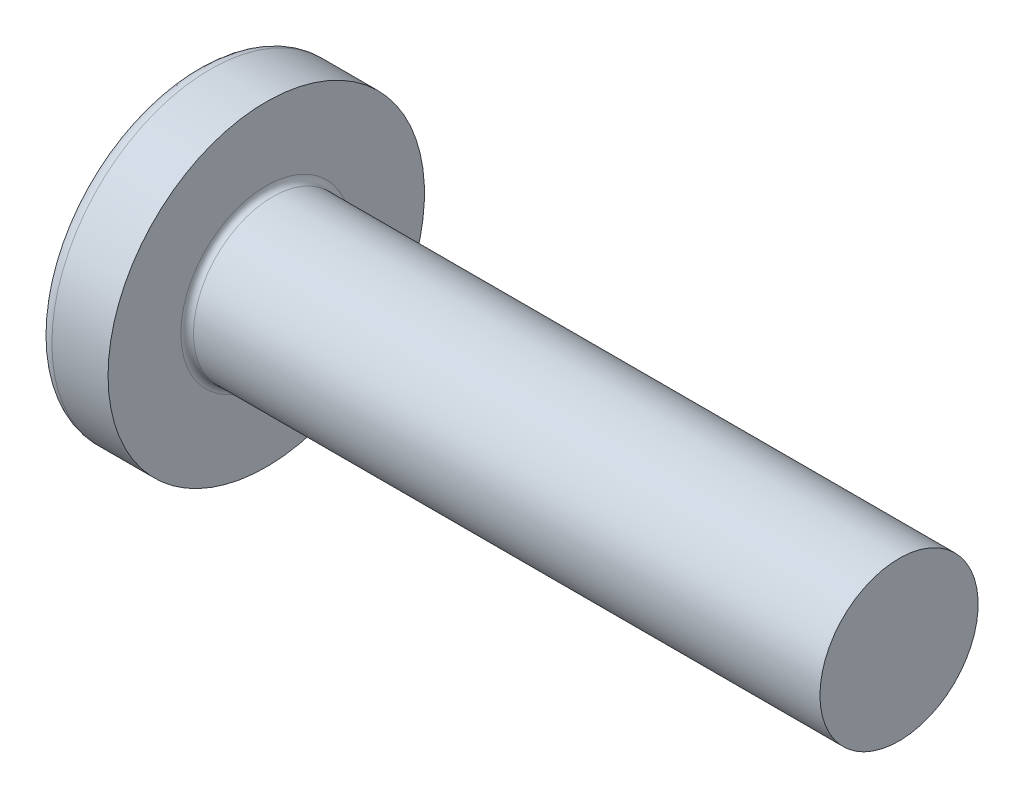
ISO-10303-21;
HEADER;
FILE_DESCRIPTION(('STEP AP214'),'2;1');
FILE_NAME('part.step','',(''),(''),'','','');
FILE_SCHEMA(('AUTOMOTIVE_DESIGN { 1 0 10303 214 1 1 1 1 }'));
ENDSEC;
DATA;
#1=APPLICATION_CONTEXT('core data for automotive mechanical design processes');
#2=APPLICATION_PROTOCOL_DEFINITION('international standard','automotive_design',2000,#1);
#3=PRODUCT_CONTEXT('',#1,'mechanical');
#4=PRODUCT('Part','Part','',(#3));
#5=PRODUCT_RELATED_PRODUCT_CATEGORY('part','',(#4));
#6=PRODUCT_DEFINITION_FORMATION('','',#4);
#7=PRODUCT_DEFINITION_CONTEXT('part definition',#1,'design');
#8=PRODUCT_DEFINITION('design','',#6,#7);
#9=PRODUCT_DEFINITION_SHAPE('','',#8);
#10=(LENGTH_UNIT() NAMED_UNIT(*) SI_UNIT(.MILLI.,.METRE.));
#11=(NAMED_UNIT(*) PLANE_ANGLE_UNIT() SI_UNIT($,.RADIAN.));
#12=(NAMED_UNIT(*) SI_UNIT($,.STERADIAN.) SOLID_ANGLE_UNIT());
#13=UNCERTAINTY_MEASURE_WITH_UNIT(LENGTH_MEASURE(1.E-05),#10,'distance_accuracy_value','');
#14=(GEOMETRIC_REPRESENTATION_CONTEXT(3) GLOBAL_UNCERTAINTY_ASSIGNED_CONTEXT((#13)) GLOBAL_UNIT_ASSIGNED_CONTEXT((#10,
#11,#12)) REPRESENTATION_CONTEXT('',''));
#15=CARTESIAN_POINT('',(0.,0.,0.));
#16=DIRECTION('',(0.,0.,1.));
#17=DIRECTION('',(1.,0.,0.));
#18=AXIS2_PLACEMENT_3D('',#15,#16,#17);
#19=CARTESIAN_POINT('',(16.,0.,0.));
#20=DIRECTION('',(-1.,0.,0.));
#21=DIRECTION('',(0.,1.,0.));
#22=AXIS2_PLACEMENT_3D('',#19,#20,#21);
#23=SPHERICAL_SURFACE('',#22,16.);
#24=CARTESIAN_POINT('',(3.23189799723057,0.,0.));
#25=DIRECTION('',(-1.,0.,0.));
#26=DIRECTION('',(0.,0.,1.));
#27=AXIS2_PLACEMENT_3D('',#24,#25,#26);
#28=CIRCLE('',#27,9.64238410596027);
#29=CARTESIAN_POINT('',(3.23189799723057,0.,9.64238410596027));
#30=VERTEX_POINT('',#29);
#31=EDGE_CURVE('E213',#30,#30,#28,.T.);
#32=ORIENTED_EDGE('',*,*,#31,.T.);
#33=EDGE_LOOP('',(#32));
#34=FACE_BOUND('',#33,.T.);
#35=CARTESIAN_POINT('',(0.168594787067849,0.,0.));
#36=DIRECTION('',(1.,0.,0.));
#37=DIRECTION('',(0.,0.,-1.));
#38=AXIS2_PLACEMENT_3D('',#35,#36,#37);
#39=CIRCLE('',#38,2.31659426398858);
#40=CARTESIAN_POINT('',(0.16859478706785,-1.07999999999999,-2.04944113941943));
#41=VERTEX_POINT('',#40);
#42=CARTESIAN_POINT('',(0.168594787067849,-2.04944113941942,-1.08));
#43=VERTEX_POINT('',#42);
#44=EDGE_CURVE('E340',#41,#43,#39,.F.);
#45=ORIENTED_EDGE('',*,*,#44,.F.);
#46=CARTESIAN_POINT('',(16.,-1.08,0.));
#47=DIRECTION('',(0.,1.,0.));
#48=DIRECTION('',(0.,0.,1.));
#49=AXIS2_PLACEMENT_3D('',#46,#47,#48);
#50=CIRCLE('',#49,15.9635083863166);
#51=CARTESIAN_POINT('',(0.712098426985781,-1.07999999999998,-4.59496088055484));
#52=VERTEX_POINT('',#51);
#53=EDGE_CURVE('E273',#52,#41,#50,.T.);
#54=ORIENTED_EDGE('',*,*,#53,.F.);
#55=CARTESIAN_POINT('',(14.7911437269581,0.,2.42459099107232));
#56=DIRECTION('',(0.446197753347436,0.,-0.894934391398443));
#57=DIRECTION('',(-0.894934391398443,0.,-0.446197753347436));
#58=AXIS2_PLACEMENT_3D('',#55,#56,#57);
#59=CIRCLE('',#58,15.7689576395251);
#60=CARTESIAN_POINT('',(0.712098426985781,1.08000000000002,-4.59496088055483));
#61=VERTEX_POINT('',#60);
#62=EDGE_CURVE('E247',#52,#61,#59,.T.);
#63=ORIENTED_EDGE('',*,*,#62,.T.);
#64=CARTESIAN_POINT('',(16.,1.08,0.));
#65=DIRECTION('',(0.,-1.,0.));
#66=DIRECTION('',(0.,0.,-1.));
#67=AXIS2_PLACEMENT_3D('',#64,#65,#66);
#68=CIRCLE('',#67,15.9635083863166);
#69=CARTESIAN_POINT('',(0.16859478706785,1.08000000000001,-2.04944113941942));
#70=VERTEX_POINT('',#69);
#71=EDGE_CURVE('E302',#70,#61,#68,.T.);
#72=ORIENTED_EDGE('',*,*,#71,.F.);
#73=CARTESIAN_POINT('',(0.168594787067849,2.04944113941941,-1.08));
#74=VERTEX_POINT('',#73);
#75=EDGE_CURVE('E355',#74,#70,#39,.F.);
#76=ORIENTED_EDGE('',*,*,#75,.F.);
#77=CARTESIAN_POINT('',(16.,0.,-1.08));
#78=DIRECTION('',(0.,0.,1.));
#79=DIRECTION('',(1.,0.,0.));
#80=AXIS2_PLACEMENT_3D('',#77,#78,#79);
#81=CIRCLE('',#80,15.9635083863166);
#82=CARTESIAN_POINT('',(0.71209842698578,4.59496088055484,-1.08));
#83=VERTEX_POINT('',#82);
#84=EDGE_CURVE('E241',#83,#74,#81,.T.);
#85=ORIENTED_EDGE('',*,*,#84,.F.);
#86=CARTESIAN_POINT('',(14.7911437269581,-2.42459099107232,0.));
#87=DIRECTION('',(0.446197753347436,0.894934391398443,0.));
#88=DIRECTION('',(-0.894934391398443,0.446197753347436,0.));
#89=AXIS2_PLACEMENT_3D('',#86,#87,#88);
#90=CIRCLE('',#89,15.7689576395251);
#91=CARTESIAN_POINT('',(0.71209842698578,4.59496088055484,1.08));
#92=VERTEX_POINT('',#91);
#93=EDGE_CURVE('E244',#83,#92,#90,.T.);
#94=ORIENTED_EDGE('',*,*,#93,.T.);
#95=CARTESIAN_POINT('',(16.,0.,1.08));
#96=DIRECTION('',(0.,0.,-1.));
#97=DIRECTION('',(0.,1.,0.));
#98=AXIS2_PLACEMENT_3D('',#95,#96,#97);
#99=CIRCLE('',#98,15.9635083863166);
#100=CARTESIAN_POINT('',(0.168594787067849,2.04944113941941,1.08));
#101=VERTEX_POINT('',#100);
#102=EDGE_CURVE('E237',#101,#92,#99,.T.);
#103=ORIENTED_EDGE('',*,*,#102,.F.);
#104=CARTESIAN_POINT('',(0.16859478706785,1.07999999999999,2.04944113941943));
#105=VERTEX_POINT('',#104);
#106=EDGE_CURVE('E354',#105,#101,#39,.F.);
#107=ORIENTED_EDGE('',*,*,#106,.F.);
#108=CARTESIAN_POINT('',(0.712098426985781,1.07999999999998,4.59496088055484));
#109=VERTEX_POINT('',#108);
#110=EDGE_CURVE('E257',#109,#105,#68,.T.);
#111=ORIENTED_EDGE('',*,*,#110,.F.);
#112=CARTESIAN_POINT('',(14.7911437269581,0.,-2.42459099107232));
#113=DIRECTION('',(0.446197753347436,0.,0.894934391398443));
#114=DIRECTION('',(0.894934391398443,0.,-0.446197753347436));
#115=AXIS2_PLACEMENT_3D('',#112,#113,#114);
#116=CIRCLE('',#115,15.7689576395251);
#117=CARTESIAN_POINT('',(0.712098426985781,-1.08000000000002,4.59496088055483));
#118=VERTEX_POINT('',#117);
#119=EDGE_CURVE('E48',#109,#118,#116,.T.);
#120=ORIENTED_EDGE('',*,*,#119,.T.);
#121=CARTESIAN_POINT('',(0.16859478706785,-1.08000000000001,2.04944113941943));
#122=VERTEX_POINT('',#121);
#123=EDGE_CURVE('E254',#122,#118,#50,.T.);
#124=ORIENTED_EDGE('',*,*,#123,.F.);
#125=CARTESIAN_POINT('',(0.168594787067849,-2.04944113941942,1.08));
#126=VERTEX_POINT('',#125);
#127=EDGE_CURVE('E390',#126,#122,#39,.F.);
#128=ORIENTED_EDGE('',*,*,#127,.F.);
#129=CARTESIAN_POINT('',(0.71209842698578,-4.59496088055483,1.08));
#130=VERTEX_POINT('',#129);
#131=EDGE_CURVE('E238',#130,#126,#99,.T.);
#132=ORIENTED_EDGE('',*,*,#131,.F.);
#133=CARTESIAN_POINT('',(14.7911437269581,2.42459099107232,0.));
#134=DIRECTION('',(0.446197753347436,-0.894934391398443,0.));
#135=DIRECTION('',(0.894934391398443,0.446197753347436,0.));
#136=AXIS2_PLACEMENT_3D('',#133,#134,#135);
#137=CIRCLE('',#136,15.7689576395251);
#138=CARTESIAN_POINT('',(0.71209842698578,-4.59496088055484,-1.08));
#139=VERTEX_POINT('',#138);
#140=EDGE_CURVE('E234',#130,#139,#137,.T.);
#141=ORIENTED_EDGE('',*,*,#140,.T.);
#142=EDGE_CURVE('E63',#43,#139,#81,.T.);
#143=ORIENTED_EDGE('',*,*,#142,.F.);
#144=EDGE_LOOP('',(#45,#54,#63,#72,#76,#85,#94,#103,#107,#111,#120,#124,#128,#132,#141,#143));
#145=FACE_BOUND('',#144,.T.);
#146=ADVANCED_FACE('F34',(#34,#145),#23,.T.);
#147=CARTESIAN_POINT('',(0.,4.94999999999999,-1.08));
#148=DIRECTION('',(0.,0.,1.));
#149=DIRECTION('',(1.,0.,0.));
#150=AXIS2_PLACEMENT_3D('',#147,#148,#149);
#151=PLANE('',#150);
#152=ORIENTED_EDGE('',*,*,#84,.T.);
#153=CARTESIAN_POINT('',(-3.43605311056389,2.33057774319368,-1.08));
#154=CARTESIAN_POINT('',(-2.73005788936149,2.27615518507628,-1.08));
#155=CARTESIAN_POINT('',(-2.02408650858328,2.22141913982355,-1.08));
#156=CARTESIAN_POINT('',(-0.612196178896327,2.11110719124856,-1.08));
#157=CARTESIAN_POINT('',(0.0937227687909008,2.05553127230215,-1.08));
#158=CARTESIAN_POINT('',(1.15253879223642,1.97137932907642,-1.08));
#159=CARTESIAN_POINT('',(1.50546717443926,1.94319732850324,-1.08));
#160=CARTESIAN_POINT('',(2.21129884226403,1.88653195912772,-1.08));
#161=CARTESIAN_POINT('',(2.56420212794819,1.85804859110097,-1.08));
#162=CARTESIAN_POINT('',(3.26997437360886,1.80073759682966,-1.08));
#163=CARTESIAN_POINT('',(3.62284333408858,1.77190997678611,-1.08));
#164=CARTESIAN_POINT('',(4.32855163516413,1.71385567830055,-1.08));
#165=CARTESIAN_POINT('',(4.68139097546501,1.68462899627166,-1.08));
#166=CARTESIAN_POINT('',(5.48196138691584,1.61778484426536,-1.08));
#167=CARTESIAN_POINT('',(5.92968063936628,1.5800255789917,-1.08));
#168=CARTESIAN_POINT('',(6.82503914618352,1.50358396776163,-1.08));
#169=CARTESIAN_POINT('',(7.27267840078262,1.46490162453115,-1.08));
#170=CARTESIAN_POINT('',(8.16783657307055,1.38637288862663,-1.08));
#171=CARTESIAN_POINT('',(8.6153554949306,1.34652654360286,-1.08));
#172=CARTESIAN_POINT('',(9.51026248486919,1.26532289179753,-1.08));
#173=CARTESIAN_POINT('',(9.95765055123334,1.22396556604181,-1.08));
#174=CARTESIAN_POINT('',(10.8523158736642,1.13920912306466,-1.08));
#175=CARTESIAN_POINT('',(11.2995930947875,1.09580963592832,-1.08));
#176=CARTESIAN_POINT('',(12.1938496891445,1.00615798148881,-1.08));
#177=CARTESIAN_POINT('',(12.6408290721386,0.959905912835485,-1.08));
#178=CARTESIAN_POINT('',(13.3109832262361,0.887238538031377,-1.08));
#179=CARTESIAN_POINT('',(13.5343356366705,0.862465479305158,-1.08));
#180=CARTESIAN_POINT('',(13.9808744583761,0.811493247434636,-1.08));
#181=CARTESIAN_POINT('',(14.204060872408,0.785294098569612,-1.08));
#182=CARTESIAN_POINT('',(14.6502320441495,0.730995725435139,-1.08));
#183=CARTESIAN_POINT('',(14.8732167746121,0.702896274763054,-1.08));
#184=CARTESIAN_POINT('',(15.2074339176581,0.658726299947166,-1.08));
#185=CARTESIAN_POINT('',(15.3187994773757,0.643665717094798,-1.08));
#186=CARTESIAN_POINT('',(15.5414149899271,0.612700054932443,-1.08));
#187=CARTESIAN_POINT('',(15.6526649406011,0.596794960123566,-1.08));
#188=CARTESIAN_POINT('',(15.7638416271016,0.580382331183072,-1.08));
#189=B_SPLINE_CURVE_WITH_KNOTS('',3,(#153,#154,#155,#156,#157,#158,#159,#160,#161,#162,#163,
#164,#165,#166,#167,#168,#169,#170,#171,#172,#173,#174,#175,#176,#177,#178,#179,#180,#181,#182,
#183,#184,#185,#186,#187,#188),.UNSPECIFIED.,.F.,.F.,(4,2,2,2,2,2,2,2,2,2,2,2,2,2,2,2,2,4),(0.,
2.12426964290659,4.24857885235091,5.3107341035929,6.37288662197896,7.43502003656715,
8.49716300414631,9.84508827634153,11.1930095684778,12.5408757584157,13.8887588800163,
15.2368871027213,16.5849687296847,17.2591314568035,17.9332827098455,18.6075144234906,
18.9446495011757,19.2817907682658),.UNSPECIFIED.);
#190=CARTESIAN_POINT('',(5.69,1.60013444747621,-1.08));
#191=VERTEX_POINT('',#190);
#192=EDGE_CURVE('E377',#74,#191,#189,.T.);
#193=ORIENTED_EDGE('',*,*,#192,.T.);
#194=DIRECTION('',(0.,1.,0.));
#195=VECTOR('',#194,1.);
#196=CARTESIAN_POINT('',(5.69,-2.11307112459984,-1.08));
#197=LINE('',#196,#195);
#198=CARTESIAN_POINT('',(5.69,2.11307112459984,-1.08));
#199=VERTEX_POINT('',#198);
#200=EDGE_CURVE('E323',#191,#199,#197,.T.);
#201=ORIENTED_EDGE('',*,*,#200,.T.);
#202=DIRECTION('',(0.894934391398442,-0.446197753347436,0.));
#203=VECTOR('',#202,1.);
#204=CARTESIAN_POINT('',(0.,4.95,-1.08));
#205=LINE('',#204,#203);
#206=EDGE_CURVE('E214',#83,#199,#205,.T.);
#207=ORIENTED_EDGE('',*,*,#206,.F.);
#208=EDGE_LOOP('',(#152,#193,#201,#207));
#209=FACE_BOUND('',#208,.T.);
#210=ADVANCED_FACE('F169',(#209),#151,.T.);
#211=CARTESIAN_POINT('',(5.69,-2.11307112459984,-1.08));
#212=VERTEX_POINT('',#211);
#213=CARTESIAN_POINT('',(5.69,-1.60013444747621,-1.08));
#214=VERTEX_POINT('',#213);
#215=EDGE_CURVE('E222',#212,#214,#197,.T.);
#216=ORIENTED_EDGE('',*,*,#215,.T.);
#217=CARTESIAN_POINT('',(-3.43605311056389,-2.33057774319368,-1.08));
#218=CARTESIAN_POINT('',(-2.73005788936149,-2.27615518507628,-1.08));
#219=CARTESIAN_POINT('',(-2.02408650858328,-2.22141913982355,-1.08));
#220=CARTESIAN_POINT('',(-0.612196178896327,-2.11110719124856,-1.08));
#221=CARTESIAN_POINT('',(0.0937227687909011,-2.05553127230214,-1.08));
#222=CARTESIAN_POINT('',(1.15253879223642,-1.97137932907642,-1.08));
#223=CARTESIAN_POINT('',(1.50546717443926,-1.94319732850324,-1.08));
#224=CARTESIAN_POINT('',(2.21129884226403,-1.88653195912772,-1.08));
#225=CARTESIAN_POINT('',(2.56420212794819,-1.85804859110097,-1.08));
#226=CARTESIAN_POINT('',(3.26997437360886,-1.80073759682966,-1.08));
#227=CARTESIAN_POINT('',(3.62284333408858,-1.77190997678611,-1.08));
#228=CARTESIAN_POINT('',(4.32855163516413,-1.71385567830055,-1.08));
#229=CARTESIAN_POINT('',(4.68139097546501,-1.68462899627166,-1.08));
#230=CARTESIAN_POINT('',(5.48196138691584,-1.61778484426536,-1.08));
#231=CARTESIAN_POINT('',(5.92968063936628,-1.5800255789917,-1.08));
#232=CARTESIAN_POINT('',(6.82503914618352,-1.50358396776163,-1.08));
#233=CARTESIAN_POINT('',(7.27267840078262,-1.46490162453115,-1.08));
#234=CARTESIAN_POINT('',(8.16783657307055,-1.38637288862663,-1.08));
#235=CARTESIAN_POINT('',(8.6153554949306,-1.34652654360286,-1.08));
#236=CARTESIAN_POINT('',(9.51026248486919,-1.26532289179753,-1.08));
#237=CARTESIAN_POINT('',(9.95765055123334,-1.22396556604181,-1.08));
#238=CARTESIAN_POINT('',(10.8523158736642,-1.13920912306466,-1.08));
#239=CARTESIAN_POINT('',(11.2995930947875,-1.09580963592832,-1.08));
#240=CARTESIAN_POINT('',(12.1938496891445,-1.00615798148881,-1.08));
#241=CARTESIAN_POINT('',(12.6408290721386,-0.959905912835485,-1.08));
#242=CARTESIAN_POINT('',(13.3109832262361,-0.887238538031376,-1.08));
#243=CARTESIAN_POINT('',(13.5343356366705,-0.862465479305157,-1.08));
#244=CARTESIAN_POINT('',(13.9808744583761,-0.811493247434636,-1.08));
#245=CARTESIAN_POINT('',(14.204060872408,-0.785294098569612,-1.08));
#246=CARTESIAN_POINT('',(14.6502320441495,-0.730995725435139,-1.08));
#247=CARTESIAN_POINT('',(14.8732167746121,-0.702896274763054,-1.08));
#248=CARTESIAN_POINT('',(15.2074339176582,-0.658726299947166,-1.08));
#249=CARTESIAN_POINT('',(15.3187994773757,-0.643665717094798,-1.08));
#250=CARTESIAN_POINT('',(15.5414149899271,-0.612700054932442,-1.08));
#251=CARTESIAN_POINT('',(15.6526649406011,-0.596794960123565,-1.08));
#252=CARTESIAN_POINT('',(15.7638416271017,-0.58038233118307,-1.08));
#253=B_SPLINE_CURVE_WITH_KNOTS('',3,(#217,#218,#219,#220,#221,#222,#223,#224,#225,#226,#227,
#228,#229,#230,#231,#232,#233,#234,#235,#236,#237,#238,#239,#240,#241,#242,#243,#244,#245,#246,
#247,#248,#249,#250,#251,#252),.UNSPECIFIED.,.F.,.F.,(4,2,2,2,2,2,2,2,2,2,2,2,2,2,2,2,2,4),(0.,
2.12426964290659,4.24857885235091,5.3107341035929,6.37288662197896,7.43502003656715,
8.49716300414631,9.84508827634152,11.1930095684778,12.5408757584157,13.8887588800163,
15.2368871027213,16.5849687296847,17.2591314568035,17.9332827098455,18.6075144234906,
18.9446495011757,19.2817907682658),.UNSPECIFIED.);
#254=EDGE_CURVE('E353',#214,#43,#253,.F.);
#255=ORIENTED_EDGE('',*,*,#254,.T.);
#256=ORIENTED_EDGE('',*,*,#142,.T.);
#257=DIRECTION('',(0.894934391398442,0.446197753347436,0.));
#258=VECTOR('',#257,1.);
#259=CARTESIAN_POINT('',(0.,-4.95,-1.08));
#260=LINE('',#259,#258);
#261=EDGE_CURVE('E305',#139,#212,#260,.T.);
#262=ORIENTED_EDGE('',*,*,#261,.T.);
#263=EDGE_LOOP('',(#216,#255,#256,#262));
#264=FACE_BOUND('',#263,.T.);
#265=ADVANCED_FACE('F175',(#264),#151,.T.);
#266=CARTESIAN_POINT('',(0.,-4.94999999999999,1.08));
#267=DIRECTION('',(0.,0.,-1.));
#268=DIRECTION('',(0.,1.,0.));
#269=AXIS2_PLACEMENT_3D('',#266,#267,#268);
#270=PLANE('',#269);
#271=DIRECTION('',(0.,-1.,0.));
#272=VECTOR('',#271,1.);
#273=CARTESIAN_POINT('',(5.69,2.11307112459984,1.08));
#274=LINE('',#273,#272);
#275=CARTESIAN_POINT('',(5.69,2.11307112459984,1.08));
#276=VERTEX_POINT('',#275);
#277=CARTESIAN_POINT('',(5.69,1.60013444747621,1.08));
#278=VERTEX_POINT('',#277);
#279=EDGE_CURVE('E313',#276,#278,#274,.T.);
#280=ORIENTED_EDGE('',*,*,#279,.T.);
#281=CARTESIAN_POINT('',(-3.43605312354531,2.33057774419416,1.08));
#282=CARTESIAN_POINT('',(-2.73005790068362,2.27615518595292,1.08));
#283=CARTESIAN_POINT('',(-2.02408651824618,2.22141914057536,1.08));
#284=CARTESIAN_POINT('',(-0.612196185240834,2.11110719174749,1.08));
#285=CARTESIAN_POINT('',(0.0937227641055553,2.055531272673,1.08));
#286=CARTESIAN_POINT('',(1.15253879056997,1.97137932920962,1.08));
#287=CARTESIAN_POINT('',(1.50546717413264,1.94319732852816,1.08));
#288=CARTESIAN_POINT('',(2.21129884467686,1.88653195893371,1.08));
#289=CARTESIAN_POINT('',(2.56420213172064,1.85804859079632,1.08));
#290=CARTESIAN_POINT('',(3.26997438010022,1.80073759630085,1.08));
#291=CARTESIAN_POINT('',(3.62284334193923,1.77190997614379,1.08));
#292=CARTESIAN_POINT('',(4.32855164573311,1.7138556774276,1.08));
#293=CARTESIAN_POINT('',(4.68139098739302,1.68462899528161,1.08));
#294=CARTESIAN_POINT('',(5.48196140020257,1.61778484314849,1.08));
#295=CARTESIAN_POINT('',(5.92968065265283,1.58002557786661,1.08));
#296=CARTESIAN_POINT('',(6.82503915946948,1.50358396661807,1.08));
#297=CARTESIAN_POINT('',(7.27267841406819,1.46490162337736,1.08));
#298=CARTESIAN_POINT('',(8.16783658635485,1.38637288744954,1.08));
#299=CARTESIAN_POINT('',(8.61535550821404,1.34652654241272,1.08));
#300=CARTESIAN_POINT('',(9.51026249815054,1.26532289057715,1.08));
#301=CARTESIAN_POINT('',(9.95765056451348,1.22396556480425,1.08));
#302=CARTESIAN_POINT('',(10.8523158869419,1.13920912178625,1.08));
#303=CARTESIAN_POINT('',(11.299593108064,1.09580963462624,1.08));
#304=CARTESIAN_POINT('',(12.1938497024173,1.0061579801289,1.08));
#305=CARTESIAN_POINT('',(12.6408290854088,0.959905911441418,1.08));
#306=CARTESIAN_POINT('',(13.3109832395008,0.887238536570858,1.08));
#307=CARTESIAN_POINT('',(13.5343356499334,0.862465477819925,1.08));
#308=CARTESIAN_POINT('',(13.9808744716342,0.811493245892373,1.08));
#309=CARTESIAN_POINT('',(14.2040608856631,0.785294096995033,1.08));
#310=CARTESIAN_POINT('',(14.6502320573974,0.730995723784125,1.08));
#311=CARTESIAN_POINT('',(14.8732167878556,0.702896273067916,1.08));
#312=CARTESIAN_POINT('',(15.2074339308928,0.658726298170583,1.08));
#313=CARTESIAN_POINT('',(15.318799490607,0.643665715288515,1.08));
#314=CARTESIAN_POINT('',(15.5414150031506,0.612700053059412,1.08));
#315=CARTESIAN_POINT('',(15.65266495382,0.596794958213487,1.08));
#316=CARTESIAN_POINT('',(15.7638416403152,0.580382329231145,1.08));
#317=B_SPLINE_CURVE_WITH_KNOTS('',3,(#281,#282,#283,#284,#285,#286,#287,#288,#289,#290,#291,
#292,#293,#294,#295,#296,#297,#298,#299,#300,#301,#302,#303,#304,#305,#306,#307,#308,#309,#310,
#311,#312,#313,#314,#315,#316),.UNSPECIFIED.,.F.,.F.,(4,2,2,2,2,2,2,2,2,2,2,2,2,2,2,2,2,4),(0.,
2.12426964789832,4.24857886233492,5.3107341176693,6.37288664014772,7.43502005882796,
8.49716303049931,9.84508830269604,11.1930095948338,12.5408757847726,13.8887589063742,
15.2368871290825,16.5849687560486,17.25913148317,17.9332827362145,18.607514449863,
18.9446495275502,19.2817907946425),.UNSPECIFIED.);
#318=EDGE_CURVE('E278',#278,#101,#317,.F.);
#319=ORIENTED_EDGE('',*,*,#318,.T.);
#320=ORIENTED_EDGE('',*,*,#102,.T.);
#321=DIRECTION('',(0.894934391398442,-0.446197753347436,0.));
#322=VECTOR('',#321,1.);
#323=CARTESIAN_POINT('',(0.,4.95,1.08));
#324=LINE('',#323,#322);
#325=EDGE_CURVE('E219',#92,#276,#324,.T.);
#326=ORIENTED_EDGE('',*,*,#325,.T.);
#327=EDGE_LOOP('',(#280,#319,#320,#326));
#328=FACE_BOUND('',#327,.T.);
#329=ADVANCED_FACE('F373',(#328),#270,.T.);
#330=ORIENTED_EDGE('',*,*,#131,.T.);
#331=CARTESIAN_POINT('',(-3.43605312354531,-2.33057774419416,1.08));
#332=CARTESIAN_POINT('',(-2.73005790068362,-2.27615518595292,1.08));
#333=CARTESIAN_POINT('',(-2.02408651824618,-2.22141914057536,1.08));
#334=CARTESIAN_POINT('',(-0.612196185240835,-2.11110719174749,1.08));
#335=CARTESIAN_POINT('',(0.0937227641055548,-2.055531272673,1.08));
#336=CARTESIAN_POINT('',(1.15253879056997,-1.97137932920962,1.08));
#337=CARTESIAN_POINT('',(1.50546717413264,-1.94319732852816,1.08));
#338=CARTESIAN_POINT('',(2.21129884467686,-1.88653195893371,1.08));
#339=CARTESIAN_POINT('',(2.56420213172064,-1.85804859079632,1.08));
#340=CARTESIAN_POINT('',(3.26997438010022,-1.80073759630085,1.08));
#341=CARTESIAN_POINT('',(3.62284334193923,-1.77190997614379,1.08));
#342=CARTESIAN_POINT('',(4.32855164573311,-1.7138556774276,1.08));
#343=CARTESIAN_POINT('',(4.68139098739302,-1.68462899528161,1.08));
#344=CARTESIAN_POINT('',(5.48196140020257,-1.61778484314849,1.08));
#345=CARTESIAN_POINT('',(5.92968065265283,-1.58002557786661,1.08));
#346=CARTESIAN_POINT('',(6.82503915946948,-1.50358396661807,1.08));
#347=CARTESIAN_POINT('',(7.27267841406818,-1.46490162337736,1.08));
#348=CARTESIAN_POINT('',(8.16783658635484,-1.38637288744954,1.08));
#349=CARTESIAN_POINT('',(8.61535550821403,-1.34652654241272,1.08));
#350=CARTESIAN_POINT('',(9.51026249815053,-1.26532289057715,1.08));
#351=CARTESIAN_POINT('',(9.95765056451346,-1.22396556480425,1.08));
#352=CARTESIAN_POINT('',(10.8523158869419,-1.13920912178625,1.08));
#353=CARTESIAN_POINT('',(11.299593108064,-1.09580963462624,1.08));
#354=CARTESIAN_POINT('',(12.1938497024173,-1.0061579801289,1.08));
#355=CARTESIAN_POINT('',(12.6408290854088,-0.959905911441419,1.08));
#356=CARTESIAN_POINT('',(13.3109832395008,-0.887238536570858,1.08));
#357=CARTESIAN_POINT('',(13.5343356499334,-0.862465477819925,1.08));
#358=CARTESIAN_POINT('',(13.9808744716342,-0.811493245892374,1.08));
#359=CARTESIAN_POINT('',(14.2040608856631,-0.785294096995035,1.08));
#360=CARTESIAN_POINT('',(14.6502320573974,-0.730995723784126,1.08));
#361=CARTESIAN_POINT('',(14.8732167878556,-0.702896273067916,1.08));
#362=CARTESIAN_POINT('',(15.2074339308928,-0.658726298170583,1.08));
#363=CARTESIAN_POINT('',(15.318799490607,-0.643665715288516,1.08));
#364=CARTESIAN_POINT('',(15.5414150031506,-0.612700053059414,1.08));
#365=CARTESIAN_POINT('',(15.65266495382,-0.596794958213489,1.08));
#366=CARTESIAN_POINT('',(15.7638416403152,-0.580382329231146,1.08));
#367=B_SPLINE_CURVE_WITH_KNOTS('',3,(#331,#332,#333,#334,#335,#336,#337,#338,#339,#340,#341,
#342,#343,#344,#345,#346,#347,#348,#349,#350,#351,#352,#353,#354,#355,#356,#357,#358,#359,#360,
#361,#362,#363,#364,#365,#366),.UNSPECIFIED.,.F.,.F.,(4,2,2,2,2,2,2,2,2,2,2,2,2,2,2,2,2,4),(0.,
2.12426964789832,4.24857886233492,5.31073411766931,6.37288664014773,7.43502005882796,
8.49716303049931,9.84508830269603,11.1930095948338,12.5408757847726,13.8887589063742,
15.2368871290825,16.5849687560486,17.25913148317,17.9332827362145,18.607514449863,
18.9446495275502,19.2817907946425),.UNSPECIFIED.);
#368=CARTESIAN_POINT('',(5.69,-1.60013444747621,1.08));
#369=VERTEX_POINT('',#368);
#370=EDGE_CURVE('E391',#126,#369,#367,.T.);
#371=ORIENTED_EDGE('',*,*,#370,.T.);
#372=CARTESIAN_POINT('',(5.69,-2.11307112459984,1.08));
#373=VERTEX_POINT('',#372);
#374=EDGE_CURVE('E315',#369,#373,#274,.T.);
#375=ORIENTED_EDGE('',*,*,#374,.T.);
#376=DIRECTION('',(0.894934391398442,0.446197753347436,0.));
#377=VECTOR('',#376,1.);
#378=CARTESIAN_POINT('',(0.,-4.95,1.08));
#379=LINE('',#378,#377);
#380=EDGE_CURVE('E307',#130,#373,#379,.T.);
#381=ORIENTED_EDGE('',*,*,#380,.F.);
#382=EDGE_LOOP('',(#330,#371,#375,#381));
#383=FACE_BOUND('',#382,.T.);
#384=ADVANCED_FACE('F421',(#383),#270,.T.);
#385=CARTESIAN_POINT('',(5.69,2.11307112459984,-1.08));
#386=DIRECTION('',(-1.,0.,0.));
#387=DIRECTION('',(0.,0.,1.));
#388=AXIS2_PLACEMENT_3D('',#385,#386,#387);
#389=PLANE('',#388);
#390=ORIENTED_EDGE('',*,*,#374,.F.);
#391=CARTESIAN_POINT('',(5.69,0.,0.));
#392=DIRECTION('',(-1.,0.,0.));
#393=DIRECTION('',(0.,0.,1.));
#394=AXIS2_PLACEMENT_3D('',#391,#392,#393);
#395=CIRCLE('',#394,1.9305);
#396=EDGE_CURVE('E348',#214,#369,#395,.T.);
#397=ORIENTED_EDGE('',*,*,#396,.F.);
#398=ORIENTED_EDGE('',*,*,#215,.F.);
#399=DIRECTION('',(0.,0.,1.));
#400=VECTOR('',#399,1.);
#401=CARTESIAN_POINT('',(5.69,-2.11307112459984,-1.08));
#402=LINE('',#401,#400);
#403=EDGE_CURVE('E310',#212,#373,#402,.T.);
#404=ORIENTED_EDGE('',*,*,#403,.T.);
#405=EDGE_LOOP('',(#390,#397,#398,#404));
#406=FACE_BOUND('',#405,.T.);
#407=ADVANCED_FACE('F414',(#406),#389,.T.);
#408=DIRECTION('',(0.,0.,-1.));
#409=VECTOR('',#408,1.);
#410=CARTESIAN_POINT('',(5.69,-1.08000000000001,2.11307112459984));
#411=LINE('',#410,#409);
#412=CARTESIAN_POINT('',(5.69,-1.07999999999999,-1.60013444747621));
#413=VERTEX_POINT('',#412);
#414=CARTESIAN_POINT('',(5.69,-1.07999999999999,-2.11307112459984));
#415=VERTEX_POINT('',#414);
#416=EDGE_CURVE('E296',#413,#415,#411,.T.);
#417=ORIENTED_EDGE('',*,*,#416,.F.);
#418=CARTESIAN_POINT('',(5.69,1.08000000000001,-1.60013444747621));
#419=VERTEX_POINT('',#418);
#420=EDGE_CURVE('E55',#419,#413,#395,.T.);
#421=ORIENTED_EDGE('',*,*,#420,.F.);
#422=DIRECTION('',(0.,0.,1.));
#423=VECTOR('',#422,1.);
#424=CARTESIAN_POINT('',(5.69,1.08000000000001,-2.11307112459984));
#425=LINE('',#424,#423);
#426=CARTESIAN_POINT('',(5.69,1.08000000000001,-2.11307112459984));
#427=VERTEX_POINT('',#426);
#428=EDGE_CURVE('E299',#427,#419,#425,.T.);
#429=ORIENTED_EDGE('',*,*,#428,.F.);
#430=DIRECTION('',(0.,-1.,0.));
#431=VECTOR('',#430,1.);
#432=CARTESIAN_POINT('',(5.69,1.08000000000001,-2.11307112459984));
#433=LINE('',#432,#431);
#434=EDGE_CURVE('E290',#427,#415,#433,.T.);
#435=ORIENTED_EDGE('',*,*,#434,.T.);
#436=EDGE_LOOP('',(#417,#421,#429,#435));
#437=FACE_BOUND('',#436,.T.);
#438=ADVANCED_FACE('F343',(#437),#389,.T.);
#439=ORIENTED_EDGE('',*,*,#200,.F.);
#440=EDGE_CURVE('E347',#278,#191,#395,.T.);
#441=ORIENTED_EDGE('',*,*,#440,.F.);
#442=ORIENTED_EDGE('',*,*,#279,.F.);
#443=DIRECTION('',(0.,0.,-1.));
#444=VECTOR('',#443,1.);
#445=CARTESIAN_POINT('',(5.69,2.11307112459984,1.08));
#446=LINE('',#445,#444);
#447=EDGE_CURVE('E316',#276,#199,#446,.T.);
#448=ORIENTED_EDGE('',*,*,#447,.T.);
#449=EDGE_LOOP('',(#439,#441,#442,#448));
#450=FACE_BOUND('',#449,.T.);
#451=ADVANCED_FACE('F415',(#450),#389,.T.);
#452=CARTESIAN_POINT('',(0.,1.07999999999998,4.95));
#453=DIRECTION('',(0.,-1.,0.));
#454=DIRECTION('',(1.,0.,0.));
#455=AXIS2_PLACEMENT_3D('',#452,#453,#454);
#456=PLANE('',#455);
#457=ORIENTED_EDGE('',*,*,#110,.T.);
#458=CARTESIAN_POINT('',(-3.43605312354531,1.07999999999999,2.33057774419416));
#459=CARTESIAN_POINT('',(-2.73005790068362,1.07999999999999,2.27615518595292));
#460=CARTESIAN_POINT('',(-2.02408651824618,1.07999999999999,2.22141914057537));
#461=CARTESIAN_POINT('',(-0.612196185240833,1.07999999999999,2.11110719174749));
#462=CARTESIAN_POINT('',(0.0937227641055562,1.07999999999999,2.05553127267301));
#463=CARTESIAN_POINT('',(1.15253879056997,1.07999999999999,1.97137932920963));
#464=CARTESIAN_POINT('',(1.50546717413264,1.07999999999999,1.94319732852816));
#465=CARTESIAN_POINT('',(2.21129884467686,1.07999999999999,1.88653195893372));
#466=CARTESIAN_POINT('',(2.56420213172064,1.07999999999999,1.85804859079632));
#467=CARTESIAN_POINT('',(3.26997438010022,1.07999999999999,1.80073759630085));
#468=CARTESIAN_POINT('',(3.62284334193923,1.07999999999999,1.77190997614379));
#469=CARTESIAN_POINT('',(4.32855164573311,1.07999999999999,1.7138556774276));
#470=CARTESIAN_POINT('',(4.68139098739302,1.07999999999999,1.68462899528162));
#471=CARTESIAN_POINT('',(5.48196140020257,1.07999999999999,1.61778484314849));
#472=CARTESIAN_POINT('',(5.92968065265283,1.07999999999999,1.58002557786661));
#473=CARTESIAN_POINT('',(6.82503915946948,1.07999999999999,1.50358396661808));
#474=CARTESIAN_POINT('',(7.27267841406819,1.07999999999999,1.46490162337736));
#475=CARTESIAN_POINT('',(8.16783658635484,1.08,1.38637288744955));
#476=CARTESIAN_POINT('',(8.61535550821403,1.08,1.34652654241272));
#477=CARTESIAN_POINT('',(9.51026249815054,1.08,1.26532289057715));
#478=CARTESIAN_POINT('',(9.95765056451347,1.08,1.22396556480425));
#479=CARTESIAN_POINT('',(10.8523158869419,1.08,1.13920912178626));
#480=CARTESIAN_POINT('',(11.299593108064,1.08,1.09580963462625));
#481=CARTESIAN_POINT('',(12.1938497024173,1.08,1.0061579801289));
#482=CARTESIAN_POINT('',(12.6408290854088,1.08,0.959905911441422));
#483=CARTESIAN_POINT('',(13.3109832395008,1.08,0.887238536570863));
#484=CARTESIAN_POINT('',(13.5343356499333,1.08,0.86246547781993));
#485=CARTESIAN_POINT('',(13.9808744716342,1.08,0.811493245892379));
#486=CARTESIAN_POINT('',(14.2040608856631,1.08,0.785294096995039));
#487=CARTESIAN_POINT('',(14.6502320573974,1.08,0.73099572378413));
#488=CARTESIAN_POINT('',(14.8732167878556,1.08,0.70289627306792));
#489=CARTESIAN_POINT('',(15.2074339308928,1.08,0.658726298170587));
#490=CARTESIAN_POINT('',(15.318799490607,1.08,0.64366571528852));
#491=CARTESIAN_POINT('',(15.5414150031506,1.08,0.612700053059418));
#492=CARTESIAN_POINT('',(15.65266495382,1.08,0.596794958213493));
#493=CARTESIAN_POINT('',(15.7638416403152,1.08,0.58038232923115));
#494=B_SPLINE_CURVE_WITH_KNOTS('',3,(#458,#459,#460,#461,#462,#463,#464,#465,#466,#467,#468,
#469,#470,#471,#472,#473,#474,#475,#476,#477,#478,#479,#480,#481,#482,#483,#484,#485,#486,#487,
#488,#489,#490,#491,#492,#493),.UNSPECIFIED.,.F.,.F.,(4,2,2,2,2,2,2,2,2,2,2,2,2,2,2,2,2,4),(0.,
2.12426964789832,4.24857886233492,5.3107341176693,6.37288664014772,7.43502005882796,
8.49716303049931,9.84508830269604,11.1930095948338,12.5408757847726,13.8887589063742,
15.2368871290825,16.5849687560486,17.25913148317,17.9332827362145,18.607514449863,
18.9446495275502,19.2817907946425),.UNSPECIFIED.);
#495=CARTESIAN_POINT('',(5.69,1.07999999999999,1.60013444747621));
#496=VERTEX_POINT('',#495);
#497=EDGE_CURVE('E439',#105,#496,#494,.T.);
#498=ORIENTED_EDGE('',*,*,#497,.T.);
#499=CARTESIAN_POINT('',(5.69,1.07999999999999,2.11307112459984));
#500=VERTEX_POINT('',#499);
#501=EDGE_CURVE('E271',#496,#500,#425,.T.);
#502=ORIENTED_EDGE('',*,*,#501,.T.);
#503=DIRECTION('',(0.894934391398442,0.,-0.446197753347436));
#504=VECTOR('',#503,1.);
#505=CARTESIAN_POINT('',(0.,1.07999999999998,4.95));
#506=LINE('',#505,#504);
#507=EDGE_CURVE('E264',#109,#500,#506,.T.);
#508=ORIENTED_EDGE('',*,*,#507,.F.);
#509=EDGE_LOOP('',(#457,#498,#502,#508));
#510=FACE_BOUND('',#509,.T.);
#511=ADVANCED_FACE('F268',(#510),#456,.T.);
#512=CARTESIAN_POINT('',(0.,-1.07999999999998,-4.95));
#513=DIRECTION('',(0.,1.,0.));
#514=DIRECTION('',(0.,0.,1.));
#515=AXIS2_PLACEMENT_3D('',#512,#513,#514);
#516=PLANE('',#515);
#517=CARTESIAN_POINT('',(5.69,-1.08000000000001,2.11307112459984));
#518=VERTEX_POINT('',#517);
#519=CARTESIAN_POINT('',(5.69,-1.08000000000001,1.60013444747621));
#520=VERTEX_POINT('',#519);
#521=EDGE_CURVE('E293',#518,#520,#411,.T.);
#522=ORIENTED_EDGE('',*,*,#521,.T.);
#523=CARTESIAN_POINT('',(-3.43605312354531,-1.08000000000001,2.33057774419416));
#524=CARTESIAN_POINT('',(-2.73005790068362,-1.08000000000001,2.27615518595292));
#525=CARTESIAN_POINT('',(-2.02408651824618,-1.08000000000001,2.22141914057536));
#526=CARTESIAN_POINT('',(-0.612196185240834,-1.08000000000001,2.11110719174748));
#527=CARTESIAN_POINT('',(0.0937227641055557,-1.08000000000001,2.055531272673));
#528=CARTESIAN_POINT('',(1.15253879056997,-1.08000000000001,1.97137932920962));
#529=CARTESIAN_POINT('',(1.50546717413264,-1.08000000000001,1.94319732852816));
#530=CARTESIAN_POINT('',(2.21129884467686,-1.08000000000001,1.88653195893371));
#531=CARTESIAN_POINT('',(2.56420213172064,-1.08000000000001,1.85804859079632));
#532=CARTESIAN_POINT('',(3.26997438010022,-1.08000000000001,1.80073759630084));
#533=CARTESIAN_POINT('',(3.62284334193923,-1.08000000000001,1.77190997614378));
#534=CARTESIAN_POINT('',(4.32855164573311,-1.08000000000001,1.7138556774276));
#535=CARTESIAN_POINT('',(4.68139098739302,-1.08000000000001,1.68462899528161));
#536=CARTESIAN_POINT('',(5.48196140020257,-1.08000000000001,1.61778484314848));
#537=CARTESIAN_POINT('',(5.92968065265283,-1.08000000000001,1.5800255778666));
#538=CARTESIAN_POINT('',(6.82503915946948,-1.08000000000001,1.50358396661807));
#539=CARTESIAN_POINT('',(7.27267841406819,-1.08000000000001,1.46490162337735));
#540=CARTESIAN_POINT('',(8.16783658635484,-1.08,1.38637288744954));
#541=CARTESIAN_POINT('',(8.61535550821403,-1.08,1.34652654241272));
#542=CARTESIAN_POINT('',(9.51026249815054,-1.08,1.26532289057715));
#543=CARTESIAN_POINT('',(9.95765056451347,-1.08,1.22396556480424));
#544=CARTESIAN_POINT('',(10.8523158869419,-1.08,1.13920912178625));
#545=CARTESIAN_POINT('',(11.299593108064,-1.08,1.09580963462624));
#546=CARTESIAN_POINT('',(12.1938497024173,-1.08,1.0061579801289));
#547=CARTESIAN_POINT('',(12.6408290854088,-1.08,0.959905911441415));
#548=CARTESIAN_POINT('',(13.3109832395008,-1.08,0.887238536570855));
#549=CARTESIAN_POINT('',(13.5343356499334,-1.08,0.862465477819922));
#550=CARTESIAN_POINT('',(13.9808744716342,-1.08,0.81149324589237));
#551=CARTESIAN_POINT('',(14.2040608856631,-1.08,0.785294096995031));
#552=CARTESIAN_POINT('',(14.6502320573974,-1.08,0.730995723784122));
#553=CARTESIAN_POINT('',(14.8732167878556,-1.08,0.702896273067913));
#554=CARTESIAN_POINT('',(15.2074339308928,-1.08,0.65872629817058));
#555=CARTESIAN_POINT('',(15.318799490607,-1.08,0.643665715288512));
#556=CARTESIAN_POINT('',(15.5414150031506,-1.08,0.612700053059409));
#557=CARTESIAN_POINT('',(15.65266495382,-1.08,0.596794958213485));
#558=CARTESIAN_POINT('',(15.7638416403152,-1.08,0.580382329231142));
#559=B_SPLINE_CURVE_WITH_KNOTS('',3,(#523,#524,#525,#526,#527,#528,#529,#530,#531,#532,#533,
#534,#535,#536,#537,#538,#539,#540,#541,#542,#543,#544,#545,#546,#547,#548,#549,#550,#551,#552,
#553,#554,#555,#556,#557,#558),.UNSPECIFIED.,.F.,.F.,(4,2,2,2,2,2,2,2,2,2,2,2,2,2,2,2,2,4),(0.,
2.12426964789832,4.24857886233492,5.3107341176693,6.37288664014772,7.43502005882796,
8.49716303049931,9.84508830269603,11.1930095948338,12.5408757847726,13.8887589063742,
15.2368871290825,16.5849687560486,17.25913148317,17.9332827362145,18.607514449863,
18.9446495275502,19.2817907946425),.UNSPECIFIED.);
#560=EDGE_CURVE('E383',#520,#122,#559,.F.);
#561=ORIENTED_EDGE('',*,*,#560,.T.);
#562=ORIENTED_EDGE('',*,*,#123,.T.);
#563=DIRECTION('',(0.894934391398442,0.,-0.446197753347436));
#564=VECTOR('',#563,1.);
#565=CARTESIAN_POINT('',(0.,-1.08000000000002,4.95));
#566=LINE('',#565,#564);
#567=EDGE_CURVE('E266',#118,#518,#566,.T.);
#568=ORIENTED_EDGE('',*,*,#567,.T.);
#569=EDGE_LOOP('',(#522,#561,#562,#568));
#570=FACE_BOUND('',#569,.T.);
#571=ADVANCED_FACE('F204',(#570),#516,.T.);
#572=ORIENTED_EDGE('',*,*,#428,.T.);
#573=CARTESIAN_POINT('',(-3.43605311056389,1.08000000000001,-2.33057774319368));
#574=CARTESIAN_POINT('',(-2.73005788936149,1.08000000000001,-2.27615518507628));
#575=CARTESIAN_POINT('',(-2.02408650858328,1.08000000000001,-2.22141913982354));
#576=CARTESIAN_POINT('',(-0.612196178896328,1.08000000000001,-2.11110719124855));
#577=CARTESIAN_POINT('',(0.0937227687909005,1.08000000000001,-2.05553127230214));
#578=CARTESIAN_POINT('',(1.15253879223642,1.08000000000001,-1.97137932907642));
#579=CARTESIAN_POINT('',(1.50546717443926,1.08000000000001,-1.94319732850324));
#580=CARTESIAN_POINT('',(2.21129884226403,1.08000000000001,-1.88653195912772));
#581=CARTESIAN_POINT('',(2.56420212794819,1.08000000000001,-1.85804859110096));
#582=CARTESIAN_POINT('',(3.26997437360885,1.08000000000001,-1.80073759682965));
#583=CARTESIAN_POINT('',(3.62284333408858,1.08000000000001,-1.77190997678611));
#584=CARTESIAN_POINT('',(4.32855163516413,1.08000000000001,-1.71385567830054));
#585=CARTESIAN_POINT('',(4.68139097546501,1.08000000000001,-1.68462899627166));
#586=CARTESIAN_POINT('',(5.48196138691584,1.08000000000001,-1.61778484426536));
#587=CARTESIAN_POINT('',(5.92968063936628,1.08000000000001,-1.5800255789917));
#588=CARTESIAN_POINT('',(6.82503914618352,1.08000000000001,-1.50358396776162));
#589=CARTESIAN_POINT('',(7.27267840078262,1.08000000000001,-1.46490162453115));
#590=CARTESIAN_POINT('',(8.16783657307055,1.08,-1.38637288862663));
#591=CARTESIAN_POINT('',(8.61535549493061,1.08,-1.34652654360286));
#592=CARTESIAN_POINT('',(9.51026248486919,1.08,-1.26532289179753));
#593=CARTESIAN_POINT('',(9.95765055123335,1.08,-1.22396556604181));
#594=CARTESIAN_POINT('',(10.8523158736642,1.08,-1.13920912306466));
#595=CARTESIAN_POINT('',(11.2995930947875,1.08,-1.09580963592832));
#596=CARTESIAN_POINT('',(12.1938496891445,1.08,-1.0061579814888));
#597=CARTESIAN_POINT('',(12.6408290721386,1.08,-0.959905912835482));
#598=CARTESIAN_POINT('',(13.3109832262361,1.08,-0.887238538031373));
#599=CARTESIAN_POINT('',(13.5343356366705,1.08,-0.862465479305154));
#600=CARTESIAN_POINT('',(13.9808744583761,1.08,-0.811493247434633));
#601=CARTESIAN_POINT('',(14.204060872408,1.08,-0.785294098569609));
#602=CARTESIAN_POINT('',(14.6502320441495,1.08,-0.730995725435136));
#603=CARTESIAN_POINT('',(14.8732167746121,1.08,-0.702896274763051));
#604=CARTESIAN_POINT('',(15.2074339176581,1.08,-0.658726299947162));
#605=CARTESIAN_POINT('',(15.3187994773757,1.08,-0.643665717094794));
#606=CARTESIAN_POINT('',(15.5414149899271,1.08,-0.612700054932439));
#607=CARTESIAN_POINT('',(15.6526649406011,1.08,-0.596794960123562));
#608=CARTESIAN_POINT('',(15.7638416271016,1.08,-0.580382331183068));
#609=B_SPLINE_CURVE_WITH_KNOTS('',3,(#573,#574,#575,#576,#577,#578,#579,#580,#581,#582,#583,
#584,#585,#586,#587,#588,#589,#590,#591,#592,#593,#594,#595,#596,#597,#598,#599,#600,#601,#602,
#603,#604,#605,#606,#607,#608),.UNSPECIFIED.,.F.,.F.,(4,2,2,2,2,2,2,2,2,2,2,2,2,2,2,2,2,4),(0.,
2.12426964290659,4.24857885235091,5.3107341035929,6.37288662197896,7.43502003656715,
8.49716300414631,9.84508827634153,11.1930095684778,12.5408757584157,13.8887588800163,
15.2368871027213,16.5849687296847,17.2591314568035,17.9332827098455,18.6075144234906,
18.9446495011757,19.2817907682658),.UNSPECIFIED.);
#610=EDGE_CURVE('E332',#419,#70,#609,.F.);
#611=ORIENTED_EDGE('',*,*,#610,.T.);
#612=ORIENTED_EDGE('',*,*,#71,.T.);
#613=DIRECTION('',(0.894934391398442,0.,0.446197753347436));
#614=VECTOR('',#613,1.);
#615=CARTESIAN_POINT('',(0.,1.08000000000002,-4.95));
#616=LINE('',#615,#614);
#617=EDGE_CURVE('E275',#61,#427,#616,.T.);
#618=ORIENTED_EDGE('',*,*,#617,.T.);
#619=EDGE_LOOP('',(#572,#611,#612,#618));
#620=FACE_BOUND('',#619,.T.);
#621=ADVANCED_FACE('F202',(#620),#456,.T.);
#622=ORIENTED_EDGE('',*,*,#53,.T.);
#623=CARTESIAN_POINT('',(-3.43605311056389,-1.07999999999999,-2.33057774319368));
#624=CARTESIAN_POINT('',(-2.73005788936149,-1.07999999999999,-2.27615518507629));
#625=CARTESIAN_POINT('',(-2.02408650858328,-1.07999999999999,-2.22141913982355));
#626=CARTESIAN_POINT('',(-0.612196178896328,-1.07999999999999,-2.11110719124856));
#627=CARTESIAN_POINT('',(0.0937227687909005,-1.07999999999999,-2.05553127230215));
#628=CARTESIAN_POINT('',(1.15253879223642,-1.07999999999999,-1.97137932907643));
#629=CARTESIAN_POINT('',(1.50546717443927,-1.07999999999999,-1.94319732850325));
#630=CARTESIAN_POINT('',(2.21129884226403,-1.07999999999999,-1.88653195912773));
#631=CARTESIAN_POINT('',(2.56420212794819,-1.07999999999999,-1.85804859110097));
#632=CARTESIAN_POINT('',(3.26997437360886,-1.07999999999999,-1.80073759682966));
#633=CARTESIAN_POINT('',(3.62284333408858,-1.07999999999999,-1.77190997678612));
#634=CARTESIAN_POINT('',(4.32855163516413,-1.07999999999999,-1.71385567830055));
#635=CARTESIAN_POINT('',(4.68139097546501,-1.07999999999999,-1.68462899627167));
#636=CARTESIAN_POINT('',(5.48196138691584,-1.07999999999999,-1.61778484426537));
#637=CARTESIAN_POINT('',(5.92968063936628,-1.07999999999999,-1.5800255789917));
#638=CARTESIAN_POINT('',(6.82503914618352,-1.07999999999999,-1.50358396776163));
#639=CARTESIAN_POINT('',(7.27267840078263,-1.07999999999999,-1.46490162453115));
#640=CARTESIAN_POINT('',(8.16783657307055,-1.07999999999999,-1.38637288862664));
#641=CARTESIAN_POINT('',(8.61535549493061,-1.08,-1.34652654360287));
#642=CARTESIAN_POINT('',(9.51026248486919,-1.08,-1.26532289179754));
#643=CARTESIAN_POINT('',(9.95765055123334,-1.08,-1.22396556604182));
#644=CARTESIAN_POINT('',(10.8523158736642,-1.08,-1.13920912306467));
#645=CARTESIAN_POINT('',(11.2995930947875,-1.08,-1.09580963592832));
#646=CARTESIAN_POINT('',(12.1938496891445,-1.08,-1.00615798148881));
#647=CARTESIAN_POINT('',(12.6408290721386,-1.08,-0.959905912835489));
#648=CARTESIAN_POINT('',(13.3109832262361,-1.08,-0.887238538031381));
#649=CARTESIAN_POINT('',(13.5343356366705,-1.08,-0.862465479305162));
#650=CARTESIAN_POINT('',(13.9808744583761,-1.08,-0.81149324743464));
#651=CARTESIAN_POINT('',(14.204060872408,-1.08,-0.785294098569616));
#652=CARTESIAN_POINT('',(14.6502320441495,-1.08,-0.730995725435143));
#653=CARTESIAN_POINT('',(14.8732167746121,-1.08,-0.702896274763058));
#654=CARTESIAN_POINT('',(15.2074339176581,-1.08,-0.65872629994717));
#655=CARTESIAN_POINT('',(15.3187994773757,-1.08,-0.643665717094802));
#656=CARTESIAN_POINT('',(15.5414149899271,-1.08,-0.612700054932447));
#657=CARTESIAN_POINT('',(15.6526649406011,-1.08,-0.59679496012357));
#658=CARTESIAN_POINT('',(15.7638416271016,-1.08,-0.580382331183076));
#659=B_SPLINE_CURVE_WITH_KNOTS('',3,(#623,#624,#625,#626,#627,#628,#629,#630,#631,#632,#633,
#634,#635,#636,#637,#638,#639,#640,#641,#642,#643,#644,#645,#646,#647,#648,#649,#650,#651,#652,
#653,#654,#655,#656,#657,#658),.UNSPECIFIED.,.F.,.F.,(4,2,2,2,2,2,2,2,2,2,2,2,2,2,2,2,2,4),(0.,
2.12426964290659,4.24857885235091,5.3107341035929,6.37288662197896,7.43502003656715,
8.49716300414631,9.84508827634153,11.1930095684778,12.5408757584157,13.8887588800163,
15.2368871027213,16.5849687296847,17.2591314568035,17.9332827098455,18.6075144234906,
18.9446495011757,19.2817907682658),.UNSPECIFIED.);
#660=EDGE_CURVE('E11',#41,#413,#659,.T.);
#661=ORIENTED_EDGE('',*,*,#660,.T.);
#662=ORIENTED_EDGE('',*,*,#416,.T.);
#663=DIRECTION('',(0.894934391398442,0.,0.446197753347436));
#664=VECTOR('',#663,1.);
#665=CARTESIAN_POINT('',(0.,-1.07999999999998,-4.95));
#666=LINE('',#665,#664);
#667=EDGE_CURVE('E287',#52,#415,#666,.T.);
#668=ORIENTED_EDGE('',*,*,#667,.F.);
#669=EDGE_LOOP('',(#622,#661,#662,#668));
#670=FACE_BOUND('',#669,.T.);
#671=ADVANCED_FACE('F197',(#670),#516,.T.);
#672=CARTESIAN_POINT('',(-25.4,0.,0.));
#673=DIRECTION('',(-1.,0.,0.));
#674=DIRECTION('',(0.,0.,1.));
#675=AXIS2_PLACEMENT_3D('',#672,#673,#674);
#676=CYLINDRICAL_SURFACE('',#675,5.);
#677=CARTESIAN_POINT('',(7.9,0.,0.));
#678=DIRECTION('',(-1.,0.,0.));
#679=DIRECTION('',(0.,0.,1.));
#680=AXIS2_PLACEMENT_3D('',#677,#678,#679);
#681=CIRCLE('',#680,5.);
#682=CARTESIAN_POINT('',(7.9,0.,5.));
#683=VERTEX_POINT('',#682);
#684=EDGE_CURVE('E208',#683,#683,#681,.F.);
#685=ORIENTED_EDGE('',*,*,#684,.T.);
#686=EDGE_LOOP('',(#685));
#687=FACE_BOUND('',#686,.T.);
#688=CARTESIAN_POINT('',(47.5,0.,0.));
#689=DIRECTION('',(-1.,0.,0.));
#690=DIRECTION('',(0.,0.,1.));
#691=AXIS2_PLACEMENT_3D('',#688,#689,#690);
#692=CIRCLE('',#691,5.);
#693=CARTESIAN_POINT('',(47.5,0.,5.));
#694=VERTEX_POINT('',#693);
#695=EDGE_CURVE('E211',#694,#694,#692,.T.);
#696=ORIENTED_EDGE('',*,*,#695,.T.);
#697=EDGE_LOOP('',(#696));
#698=FACE_BOUND('',#697,.T.);
#699=ADVANCED_FACE('F194',(#687,#698),#676,.T.);
#700=CARTESIAN_POINT('',(7.5,5.,0.));
#701=DIRECTION('',(-1.,0.,0.));
#702=DIRECTION('',(0.,0.,1.));
#703=AXIS2_PLACEMENT_3D('',#700,#701,#702);
#704=PLANE('',#703);
#705=CARTESIAN_POINT('',(7.5,0.,0.));
#706=DIRECTION('',(-1.,0.,0.));
#707=DIRECTION('',(0.,0.,1.));
#708=AXIS2_PLACEMENT_3D('',#705,#706,#707);
#709=CIRCLE('',#708,5.4);
#710=CARTESIAN_POINT('',(7.5,0.,5.4));
#711=VERTEX_POINT('',#710);
#712=EDGE_CURVE('E230',#711,#711,#709,.T.);
#713=ORIENTED_EDGE('',*,*,#712,.T.);
#714=EDGE_LOOP('',(#713));
#715=FACE_BOUND('',#714,.T.);
#716=CARTESIAN_POINT('',(7.5,0.,0.));
#717=DIRECTION('',(-1.,0.,0.));
#718=DIRECTION('',(0.,0.,1.));
#719=AXIS2_PLACEMENT_3D('',#716,#717,#718);
#720=CIRCLE('',#719,10.);
#721=CARTESIAN_POINT('',(7.5,0.,10.));
#722=VERTEX_POINT('',#721);
#723=EDGE_CURVE('E227',#722,#722,#720,.T.);
#724=ORIENTED_EDGE('',*,*,#723,.F.);
#725=EDGE_LOOP('',(#724));
#726=FACE_BOUND('',#725,.T.);
#727=ADVANCED_FACE('F191',(#715,#726),#704,.F.);
#728=CARTESIAN_POINT('',(-25.4,0.,0.));
#729=DIRECTION('',(-1.,0.,0.));
#730=DIRECTION('',(0.,0.,1.));
#731=AXIS2_PLACEMENT_3D('',#728,#729,#730);
#732=CYLINDRICAL_SURFACE('',#731,10.);
#733=ORIENTED_EDGE('',*,*,#723,.T.);
#734=EDGE_LOOP('',(#733));
#735=FACE_BOUND('',#734,.T.);
#736=CARTESIAN_POINT('',(3.95010373488635,0.,0.));
#737=DIRECTION('',(-1.,0.,0.));
#738=DIRECTION('',(0.,0.,1.));
#739=AXIS2_PLACEMENT_3D('',#736,#737,#738);
#740=CIRCLE('',#739,10.);
#741=CARTESIAN_POINT('',(3.95010373488635,0.,10.));
#742=VERTEX_POINT('',#741);
#743=EDGE_CURVE('E216',#742,#742,#740,.T.);
#744=ORIENTED_EDGE('',*,*,#743,.F.);
#745=EDGE_LOOP('',(#744));
#746=FACE_BOUND('',#745,.T.);
#747=ADVANCED_FACE('F187',(#735,#746),#732,.T.);
#748=CARTESIAN_POINT('',(3.95010373488635,0.,0.));
#749=DIRECTION('',(-1.,0.,0.));
#750=DIRECTION('',(0.,0.,1.));
#751=AXIS2_PLACEMENT_3D('',#748,#749,#750);
#752=TOROIDAL_SURFACE('',#751,9.1,0.900000000000001);
#753=ORIENTED_EDGE('',*,*,#743,.T.);
#754=EDGE_LOOP('',(#753));
#755=FACE_BOUND('',#754,.T.);
#756=ORIENTED_EDGE('',*,*,#31,.F.);
#757=EDGE_LOOP('',(#756));
#758=FACE_BOUND('',#757,.T.);
#759=ADVANCED_FACE('F184',(#755,#758),#752,.T.);
#760=CARTESIAN_POINT('',(47.5,5.,0.));
#761=DIRECTION('',(1.,0.,0.));
#762=DIRECTION('',(0.,0.,-1.));
#763=AXIS2_PLACEMENT_3D('',#760,#761,#762);
#764=PLANE('',#763);
#765=ORIENTED_EDGE('',*,*,#695,.F.);
#766=EDGE_LOOP('',(#765));
#767=FACE_BOUND('',#766,.T.);
#768=ADVANCED_FACE('F182',(#767),#764,.T.);
#769=CARTESIAN_POINT('',(7.9,0.,0.));
#770=DIRECTION('',(-1.,0.,0.));
#771=DIRECTION('',(0.,0.,1.));
#772=AXIS2_PLACEMENT_3D('',#769,#770,#771);
#773=TOROIDAL_SURFACE('',#772,5.4,0.4);
#774=ORIENTED_EDGE('',*,*,#684,.F.);
#775=EDGE_LOOP('',(#774));
#776=FACE_BOUND('',#775,.T.);
#777=ORIENTED_EDGE('',*,*,#712,.F.);
#778=EDGE_LOOP('',(#777));
#779=FACE_BOUND('',#778,.T.);
#780=ADVANCED_FACE('F36',(#776,#779),#773,.F.);
#781=CARTESIAN_POINT('',(5.69,2.11307112459984,1.08));
#782=DIRECTION('',(0.446197753347436,0.894934391398443,0.));
#783=DIRECTION('',(-0.894934391398443,0.446197753347436,0.));
#784=AXIS2_PLACEMENT_3D('',#781,#782,#783);
#785=PLANE('',#784);
#786=ORIENTED_EDGE('',*,*,#206,.T.);
#787=ORIENTED_EDGE('',*,*,#447,.F.);
#788=ORIENTED_EDGE('',*,*,#325,.F.);
#789=ORIENTED_EDGE('',*,*,#93,.F.);
#790=EDGE_LOOP('',(#786,#787,#788,#789));
#791=FACE_BOUND('',#790,.T.);
#792=ADVANCED_FACE('F371',(#791),#785,.F.);
#793=CARTESIAN_POINT('',(0.,-4.95,-1.08));
#794=DIRECTION('',(0.446197753347436,-0.894934391398443,0.));
#795=DIRECTION('',(0.894934391398443,0.446197753347436,0.));
#796=AXIS2_PLACEMENT_3D('',#793,#794,#795);
#797=PLANE('',#796);
#798=ORIENTED_EDGE('',*,*,#380,.T.);
#799=ORIENTED_EDGE('',*,*,#403,.F.);
#800=ORIENTED_EDGE('',*,*,#261,.F.);
#801=ORIENTED_EDGE('',*,*,#140,.F.);
#802=EDGE_LOOP('',(#798,#799,#800,#801));
#803=FACE_BOUND('',#802,.T.);
#804=ADVANCED_FACE('F412',(#803),#797,.F.);
#805=ORIENTED_EDGE('',*,*,#501,.F.);
#806=EDGE_CURVE('E351',#520,#496,#395,.T.);
#807=ORIENTED_EDGE('',*,*,#806,.F.);
#808=ORIENTED_EDGE('',*,*,#521,.F.);
#809=DIRECTION('',(0.,1.,0.));
#810=VECTOR('',#809,1.);
#811=CARTESIAN_POINT('',(5.69,-1.08000000000001,2.11307112459984));
#812=LINE('',#811,#810);
#813=EDGE_CURVE('E297',#518,#500,#812,.T.);
#814=ORIENTED_EDGE('',*,*,#813,.T.);
#815=EDGE_LOOP('',(#805,#807,#808,#814));
#816=FACE_BOUND('',#815,.T.);
#817=ADVANCED_FACE('F408',(#816),#389,.T.);
#818=CARTESIAN_POINT('',(5.69,-1.08000000000001,2.11307112459984));
#819=DIRECTION('',(0.446197753347436,0.,0.894934391398443));
#820=DIRECTION('',(-0.894934391398443,0.,0.446197753347436));
#821=AXIS2_PLACEMENT_3D('',#818,#819,#820);
#822=PLANE('',#821);
#823=ORIENTED_EDGE('',*,*,#507,.T.);
#824=ORIENTED_EDGE('',*,*,#813,.F.);
#825=ORIENTED_EDGE('',*,*,#567,.F.);
#826=ORIENTED_EDGE('',*,*,#119,.F.);
#827=EDGE_LOOP('',(#823,#824,#825,#826));
#828=FACE_BOUND('',#827,.T.);
#829=ADVANCED_FACE('F262',(#828),#822,.F.);
#830=CARTESIAN_POINT('',(0.,1.08000000000002,-4.95));
#831=DIRECTION('',(0.446197753347436,0.,-0.894934391398443));
#832=DIRECTION('',(0.894934391398443,0.,0.446197753347436));
#833=AXIS2_PLACEMENT_3D('',#830,#831,#832);
#834=PLANE('',#833);
#835=ORIENTED_EDGE('',*,*,#667,.T.);
#836=ORIENTED_EDGE('',*,*,#434,.F.);
#837=ORIENTED_EDGE('',*,*,#617,.F.);
#838=ORIENTED_EDGE('',*,*,#62,.F.);
#839=EDGE_LOOP('',(#835,#836,#837,#838));
#840=FACE_BOUND('',#839,.T.);
#841=ADVANCED_FACE('F335',(#840),#834,.F.);
#842=CARTESIAN_POINT('',(5.69,0.,0.));
#843=DIRECTION('',(-1.,0.,0.));
#844=DIRECTION('',(0.,0.,1.));
#845=AXIS2_PLACEMENT_3D('',#842,#843,#844);
#846=CONICAL_SURFACE('',#845,1.9305,0.0698131700797659);
#847=EDGE_CURVE('E349',#496,#278,#395,.T.);
#848=ORIENTED_EDGE('',*,*,#847,.F.);
#849=ORIENTED_EDGE('',*,*,#497,.F.);
#850=ORIENTED_EDGE('',*,*,#106,.T.);
#851=ORIENTED_EDGE('',*,*,#318,.F.);
#852=EDGE_LOOP('',(#848,#849,#850,#851));
#853=FACE_BOUND('',#852,.T.);
#854=ADVANCED_FACE('F166',(#853),#846,.F.);
#855=ORIENTED_EDGE('',*,*,#127,.T.);
#856=ORIENTED_EDGE('',*,*,#560,.F.);
#857=EDGE_CURVE('E448',#369,#520,#395,.T.);
#858=ORIENTED_EDGE('',*,*,#857,.F.);
#859=ORIENTED_EDGE('',*,*,#370,.F.);
#860=EDGE_LOOP('',(#855,#856,#858,#859));
#861=FACE_BOUND('',#860,.T.);
#862=ADVANCED_FACE('F406',(#861),#846,.F.);
#863=ORIENTED_EDGE('',*,*,#75,.T.);
#864=ORIENTED_EDGE('',*,*,#610,.F.);
#865=EDGE_CURVE('E344',#191,#419,#395,.T.);
#866=ORIENTED_EDGE('',*,*,#865,.F.);
#867=ORIENTED_EDGE('',*,*,#192,.F.);
#868=EDGE_LOOP('',(#863,#864,#866,#867));
#869=FACE_BOUND('',#868,.T.);
#870=ADVANCED_FACE('F164',(#869),#846,.F.);
#871=EDGE_CURVE('E345',#413,#214,#395,.T.);
#872=ORIENTED_EDGE('',*,*,#871,.F.);
#873=ORIENTED_EDGE('',*,*,#660,.F.);
#874=ORIENTED_EDGE('',*,*,#44,.T.);
#875=ORIENTED_EDGE('',*,*,#254,.F.);
#876=EDGE_LOOP('',(#872,#873,#874,#875));
#877=FACE_BOUND('',#876,.T.);
#878=ADVANCED_FACE('F159',(#877),#846,.F.);
#879=CARTESIAN_POINT('',(6.31725747357761,0.,0.));
#880=DIRECTION('',(-1.,0.,0.));
#881=DIRECTION('',(0.,0.,1.));
#882=AXIS2_PLACEMENT_3D('',#879,#880,#881);
#883=CONICAL_SURFACE('',#882,0.,1.25663706143592);
#884=ORIENTED_EDGE('',*,*,#847,.T.);
#885=ORIENTED_EDGE('',*,*,#440,.T.);
#886=ORIENTED_EDGE('',*,*,#865,.T.);
#887=ORIENTED_EDGE('',*,*,#420,.T.);
#888=ORIENTED_EDGE('',*,*,#871,.T.);
#889=ORIENTED_EDGE('',*,*,#396,.T.);
#890=ORIENTED_EDGE('',*,*,#857,.T.);
#891=ORIENTED_EDGE('',*,*,#806,.T.);
#892=EDGE_LOOP('',(#884,#885,#886,#887,#888,#889,#890,#891));
#893=FACE_BOUND('',#892,.T.);
#894=CARTESIAN_POINT('',(6.31725747357761,0.,0.));
#895=VERTEX_POINT('',#894);
#896=VERTEX_LOOP('',#895);
#897=FACE_BOUND('',#896,.T.);
#898=ADVANCED_FACE('F157',(#893,#897),#883,.F.);
#899=CLOSED_SHELL('',(#146,#210,#265,#329,#384,#407,#438,#451,#511,#571,#621,#671,#699,#727,
#747,#759,#768,#780,#792,#804,#817,#829,#841,#854,#862,#870,#878,#898));
#900=MANIFOLD_SOLID_BREP('B2',#899);
#901=ADVANCED_BREP_SHAPE_REPRESENTATION('',(#18,#900),#14);
#902=SHAPE_DEFINITION_REPRESENTATION(#9,#901);
ENDSEC;
END-ISO-10303-21;
